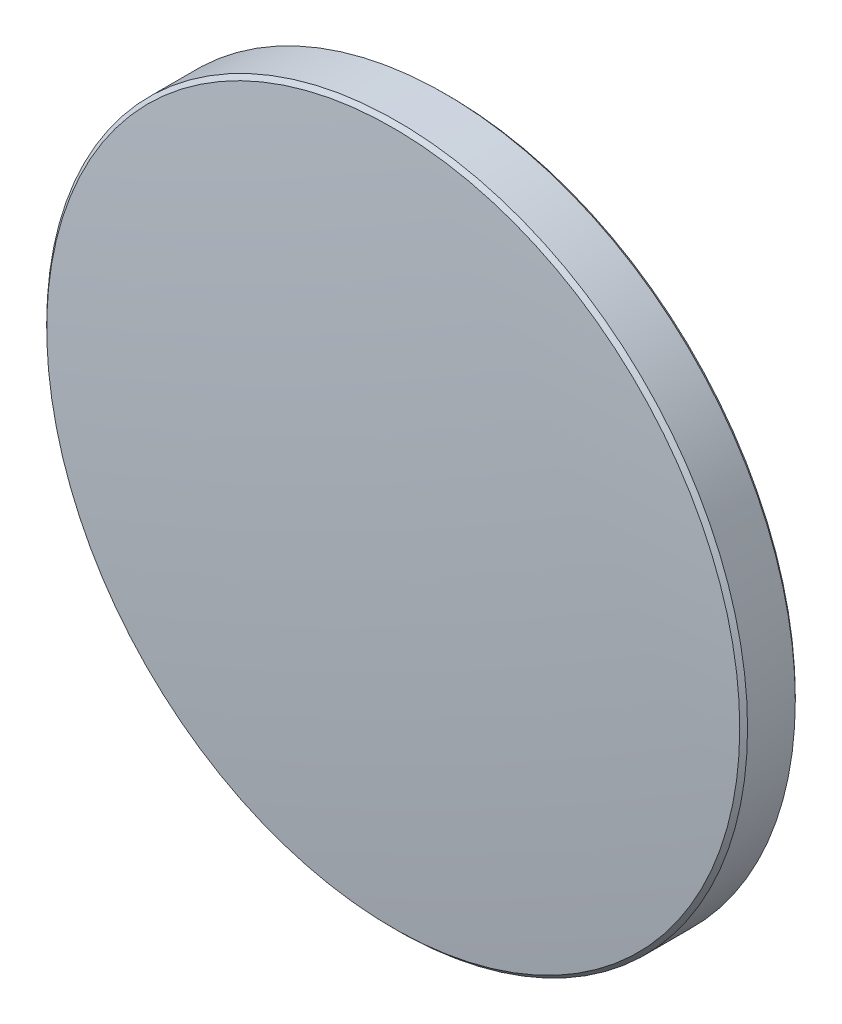
ISO-10303-21;
HEADER;
FILE_DESCRIPTION(('STEP AP214'),'2;1');
FILE_NAME('part.step','',(''),(''),'','','');
FILE_SCHEMA(('AUTOMOTIVE_DESIGN { 1 0 10303 214 1 1 1 1 }'));
ENDSEC;
DATA;
#1=APPLICATION_CONTEXT('core data for automotive mechanical design processes');
#2=APPLICATION_PROTOCOL_DEFINITION('international standard','automotive_design',2000,#1);
#3=PRODUCT_CONTEXT('',#1,'mechanical');
#4=PRODUCT('Part','Part','',(#3));
#5=PRODUCT_RELATED_PRODUCT_CATEGORY('part','',(#4));
#6=PRODUCT_DEFINITION_FORMATION('','',#4);
#7=PRODUCT_DEFINITION_CONTEXT('part definition',#1,'design');
#8=PRODUCT_DEFINITION('design','',#6,#7);
#9=PRODUCT_DEFINITION_SHAPE('','',#8);
#10=(LENGTH_UNIT() NAMED_UNIT(*) SI_UNIT(.MILLI.,.METRE.));
#11=(NAMED_UNIT(*) PLANE_ANGLE_UNIT() SI_UNIT($,.RADIAN.));
#12=(NAMED_UNIT(*) SI_UNIT($,.STERADIAN.) SOLID_ANGLE_UNIT());
#13=UNCERTAINTY_MEASURE_WITH_UNIT(LENGTH_MEASURE(1.E-05),#10,'distance_accuracy_value','');
#14=(GEOMETRIC_REPRESENTATION_CONTEXT(3) GLOBAL_UNCERTAINTY_ASSIGNED_CONTEXT((#13)) GLOBAL_UNIT_ASSIGNED_CONTEXT((#10,
#11,#12)) REPRESENTATION_CONTEXT('',''));
#15=CARTESIAN_POINT('',(0.,0.,0.));
#16=DIRECTION('',(0.,0.,1.));
#17=DIRECTION('',(1.,0.,0.));
#18=AXIS2_PLACEMENT_3D('',#15,#16,#17);
#19=CARTESIAN_POINT('',(-0.0482476397285405,0.,-136.724991567038));
#20=DIRECTION('',(0.,-1.,0.));
#21=DIRECTION('',(1.,0.,0.));
#22=AXIS2_PLACEMENT_3D('',#19,#20,#21);
#23=CIRCLE('',#22,138.02);
#24=TRIMMED_CURVE('',#23,(PARAMETER_VALUE(-1.57044675687234)),
(PARAMETER_VALUE(1.57044675687234)),.T.,.PARAMETER.);
#25=CARTESIAN_POINT('',(0.,0.,-136.724991567038));
#26=DIRECTION('',(0.,0.,1.));
#27=AXIS1_PLACEMENT('',#25,#26);
#28=SURFACE_OF_REVOLUTION('',#24,#27);
#29=CARTESIAN_POINT('',(0.,0.,1.295));
#30=VERTEX_POINT('',#29);
#31=VERTEX_LOOP('',#30);
#32=FACE_BOUND('',#31,.T.);
#33=CARTESIAN_POINT('',(0.,0.,0.718045110190054));
#34=DIRECTION('',(0.,0.,1.));
#35=DIRECTION('',(1.,0.,0.));
#36=AXIS2_PLACEMENT_3D('',#33,#34,#35);
#37=CIRCLE('',#36,12.5585786437627);
#38=CARTESIAN_POINT('',(12.5585786437627,0.,0.718045110190054));
#39=VERTEX_POINT('',#38);
#40=EDGE_CURVE('E29',#39,#39,#37,.T.);
#41=ORIENTED_EDGE('',*,*,#40,.T.);
#42=EDGE_LOOP('',(#41));
#43=FACE_BOUND('',#42,.T.);
#44=ADVANCED_FACE('F15',(#32,#43),#28,.T.);
#45=CARTESIAN_POINT('',(0.,0.,-1.295));
#46=DIRECTION('',(0.,0.,1.));
#47=DIRECTION('',(1.,0.,0.));
#48=AXIS2_PLACEMENT_3D('',#45,#46,#47);
#49=PLANE('',#48);
#50=CARTESIAN_POINT('',(0.,0.,-1.295));
#51=DIRECTION('',(0.,0.,1.));
#52=DIRECTION('',(1.,0.,0.));
#53=AXIS2_PLACEMENT_3D('',#50,#51,#52);
#54=CIRCLE('',#53,12.5585786437627);
#55=CARTESIAN_POINT('',(12.5585786437627,0.,-1.295));
#56=VERTEX_POINT('',#55);
#57=EDGE_CURVE('E10',#56,#56,#54,.T.);
#58=ORIENTED_EDGE('',*,*,#57,.F.);
#59=EDGE_LOOP('',(#58));
#60=FACE_BOUND('',#59,.T.);
#61=ADVANCED_FACE('F26',(#60),#49,.F.);
#62=CARTESIAN_POINT('',(0.,0.,-1.295));
#63=DIRECTION('',(0.,0.,1.));
#64=DIRECTION('',(1.,0.,0.));
#65=AXIS2_PLACEMENT_3D('',#62,#63,#64);
#66=CONICAL_SURFACE('',#65,12.5585786437627,0.785398163397448);
#67=CARTESIAN_POINT('',(0.,0.,-1.15357864376269));
#68=DIRECTION('',(0.,0.,1.));
#69=DIRECTION('',(1.,0.,0.));
#70=AXIS2_PLACEMENT_3D('',#67,#68,#69);
#71=CIRCLE('',#70,12.7);
#72=CARTESIAN_POINT('',(12.7,0.,-1.15357864376269));
#73=VERTEX_POINT('',#72);
#74=EDGE_CURVE('E21',#73,#73,#71,.T.);
#75=ORIENTED_EDGE('',*,*,#74,.F.);
#76=EDGE_LOOP('',(#75));
#77=FACE_BOUND('',#76,.T.);
#78=ORIENTED_EDGE('',*,*,#57,.T.);
#79=EDGE_LOOP('',(#78));
#80=FACE_BOUND('',#79,.T.);
#81=ADVANCED_FACE('F40',(#77,#80),#66,.T.);
#82=CARTESIAN_POINT('',(0.,0.,16.0135549997621));
#83=DIRECTION('',(0.,0.,1.));
#84=DIRECTION('',(1.,0.,0.));
#85=AXIS2_PLACEMENT_3D('',#82,#83,#84);
#86=CYLINDRICAL_SURFACE('',#85,12.7);
#87=CARTESIAN_POINT('',(0.,0.,0.576623753952742));
#88=DIRECTION('',(0.,0.,1.));
#89=DIRECTION('',(1.,0.,0.));
#90=AXIS2_PLACEMENT_3D('',#87,#88,#89);
#91=CIRCLE('',#90,12.7);
#92=CARTESIAN_POINT('',(12.7,0.,0.576623753952742));
#93=VERTEX_POINT('',#92);
#94=EDGE_CURVE('E31',#93,#93,#91,.T.);
#95=ORIENTED_EDGE('',*,*,#94,.F.);
#96=EDGE_LOOP('',(#95));
#97=FACE_BOUND('',#96,.T.);
#98=ORIENTED_EDGE('',*,*,#74,.T.);
#99=EDGE_LOOP('',(#98));
#100=FACE_BOUND('',#99,.T.);
#101=ADVANCED_FACE('F38',(#97,#100),#86,.T.);
#102=CARTESIAN_POINT('',(0.,0.,0.576623753952742));
#103=DIRECTION('',(0.,0.,-1.));
#104=DIRECTION('',(-1.,0.,0.));
#105=AXIS2_PLACEMENT_3D('',#102,#103,#104);
#106=CONICAL_SURFACE('',#105,12.7,0.785398163397436);
#107=ORIENTED_EDGE('',*,*,#40,.F.);
#108=EDGE_LOOP('',(#107));
#109=FACE_BOUND('',#108,.T.);
#110=ORIENTED_EDGE('',*,*,#94,.T.);
#111=EDGE_LOOP('',(#110));
#112=FACE_BOUND('',#111,.T.);
#113=ADVANCED_FACE('F54',(#109,#112),#106,.T.);
#114=CLOSED_SHELL('',(#44,#61,#81,#101,#113));
#115=MANIFOLD_SOLID_BREP('B1',#114);
#116=ADVANCED_BREP_SHAPE_REPRESENTATION('',(#18,#115),#14);
#117=SHAPE_DEFINITION_REPRESENTATION(#9,#116);
ENDSEC;
END-ISO-10303-21;
